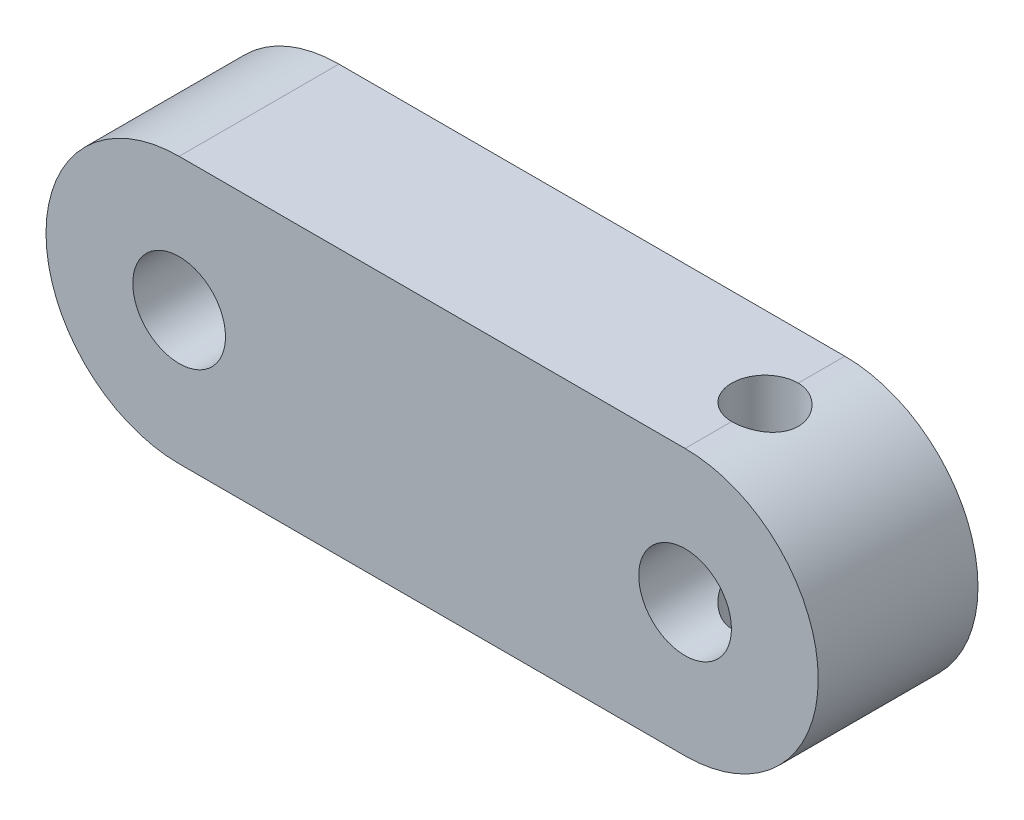
ISO-10303-21;
HEADER;
FILE_DESCRIPTION(('STEP AP214'),'2;1');
FILE_NAME('part.step','',(''),(''),'','','');
FILE_SCHEMA(('AUTOMOTIVE_DESIGN { 1 0 10303 214 1 1 1 1 }'));
ENDSEC;
DATA;
#1=APPLICATION_CONTEXT('core data for automotive mechanical design processes');
#2=APPLICATION_PROTOCOL_DEFINITION('international standard','automotive_design',2000,#1);
#3=PRODUCT_CONTEXT('',#1,'mechanical');
#4=PRODUCT('Part','Part','',(#3));
#5=PRODUCT_RELATED_PRODUCT_CATEGORY('part','',(#4));
#6=PRODUCT_DEFINITION_FORMATION('','',#4);
#7=PRODUCT_DEFINITION_CONTEXT('part definition',#1,'design');
#8=PRODUCT_DEFINITION('design','',#6,#7);
#9=PRODUCT_DEFINITION_SHAPE('','',#8);
#10=(LENGTH_UNIT() NAMED_UNIT(*) SI_UNIT(.MILLI.,.METRE.));
#11=(NAMED_UNIT(*) PLANE_ANGLE_UNIT() SI_UNIT($,.RADIAN.));
#12=(NAMED_UNIT(*) SI_UNIT($,.STERADIAN.) SOLID_ANGLE_UNIT());
#13=UNCERTAINTY_MEASURE_WITH_UNIT(LENGTH_MEASURE(1.E-05),#10,'distance_accuracy_value','');
#14=(GEOMETRIC_REPRESENTATION_CONTEXT(3) GLOBAL_UNCERTAINTY_ASSIGNED_CONTEXT((#13)) GLOBAL_UNIT_ASSIGNED_CONTEXT((#10,
#11,#12)) REPRESENTATION_CONTEXT('',''));
#15=CARTESIAN_POINT('',(0.,0.,0.));
#16=DIRECTION('',(0.,0.,1.));
#17=DIRECTION('',(1.,0.,0.));
#18=AXIS2_PLACEMENT_3D('',#15,#16,#17);
#19=CARTESIAN_POINT('',(-35.0424528301887,-0.806603773584906,6.));
#20=DIRECTION('',(0.,0.,-1.));
#21=DIRECTION('',(-1.,0.,0.));
#22=AXIS2_PLACEMENT_3D('',#19,#20,#21);
#23=CYLINDRICAL_SURFACE('',#22,5.);
#24=CARTESIAN_POINT('',(-35.0424528301887,-0.806603773584906,0.));
#25=DIRECTION('',(0.,0.,1.));
#26=DIRECTION('',(1.,0.,0.));
#27=AXIS2_PLACEMENT_3D('',#24,#25,#26);
#28=CIRCLE('',#27,5.);
#29=CARTESIAN_POINT('',(-35.0424528301887,4.19339622641509,0.));
#30=VERTEX_POINT('',#29);
#31=CARTESIAN_POINT('',(-35.0424528301887,-5.80660377358491,0.));
#32=VERTEX_POINT('',#31);
#33=EDGE_CURVE('E177',#30,#32,#28,.T.);
#34=ORIENTED_EDGE('',*,*,#33,.T.);
#35=DIRECTION('',(0.,0.,-1.));
#36=VECTOR('',#35,1.);
#37=CARTESIAN_POINT('',(-35.0424528301887,-5.80660377358491,6.));
#38=LINE('',#37,#36);
#39=CARTESIAN_POINT('',(-35.0424528301887,-5.80660377358491,6.));
#40=VERTEX_POINT('',#39);
#41=EDGE_CURVE('E11',#40,#32,#38,.T.);
#42=ORIENTED_EDGE('',*,*,#41,.F.);
#43=CARTESIAN_POINT('',(-35.0424528301887,-0.806603773584906,6.));
#44=DIRECTION('',(0.,0.,1.));
#45=DIRECTION('',(1.,0.,0.));
#46=AXIS2_PLACEMENT_3D('',#43,#44,#45);
#47=CIRCLE('',#46,5.);
#48=CARTESIAN_POINT('',(-35.0424528301887,4.19339622641509,6.));
#49=VERTEX_POINT('',#48);
#50=EDGE_CURVE('E222',#49,#40,#47,.T.);
#51=ORIENTED_EDGE('',*,*,#50,.F.);
#52=DIRECTION('',(0.,0.,-1.));
#53=VECTOR('',#52,1.);
#54=CARTESIAN_POINT('',(-35.0424528301887,4.19339622641509,6.));
#55=LINE('',#54,#53);
#56=EDGE_CURVE('E179',#49,#30,#55,.T.);
#57=ORIENTED_EDGE('',*,*,#56,.T.);
#58=EDGE_LOOP('',(#34,#42,#51,#57));
#59=FACE_BOUND('',#58,.T.);
#60=ADVANCED_FACE('F47',(#59),#23,.T.);
#61=CARTESIAN_POINT('',(0.,-5.80660377358491,6.));
#62=DIRECTION('',(0.,1.,0.));
#63=DIRECTION('',(0.,0.,1.));
#64=AXIS2_PLACEMENT_3D('',#61,#62,#63);
#65=PLANE('',#64);
#66=DIRECTION('',(0.,0.,-1.));
#67=VECTOR('',#66,1.);
#68=CARTESIAN_POINT('',(-16.0424528301887,-5.80660377358491,6.));
#69=LINE('',#68,#67);
#70=CARTESIAN_POINT('',(-16.0424528301887,-5.80660377358491,1.75));
#71=VERTEX_POINT('',#70);
#72=CARTESIAN_POINT('',(-16.0424528301887,-5.80660377358491,0.));
#73=VERTEX_POINT('',#72);
#74=EDGE_CURVE('E118',#71,#73,#69,.T.);
#75=ORIENTED_EDGE('',*,*,#74,.F.);
#76=CARTESIAN_POINT('',(-16.0424528301887,-5.80660377358491,3.));
#77=DIRECTION('',(0.,1.,0.));
#78=DIRECTION('',(0.,0.,1.));
#79=AXIS2_PLACEMENT_3D('',#76,#77,#78);
#80=CIRCLE('',#79,1.25);
#81=CARTESIAN_POINT('',(-16.0424528301887,-5.80660377358491,4.25));
#82=VERTEX_POINT('',#81);
#83=EDGE_CURVE('E69',#71,#82,#80,.T.);
#84=ORIENTED_EDGE('',*,*,#83,.T.);
#85=CARTESIAN_POINT('',(-16.0424528301887,-5.80660377358491,6.));
#86=VERTEX_POINT('',#85);
#87=EDGE_CURVE('E62',#86,#82,#69,.T.);
#88=ORIENTED_EDGE('',*,*,#87,.F.);
#89=DIRECTION('',(1.,0.,0.));
#90=VECTOR('',#89,1.);
#91=CARTESIAN_POINT('',(0.,-5.80660377358491,6.));
#92=LINE('',#91,#90);
#93=EDGE_CURVE('E219',#40,#86,#92,.T.);
#94=ORIENTED_EDGE('',*,*,#93,.F.);
#95=ORIENTED_EDGE('',*,*,#41,.T.);
#96=DIRECTION('',(1.,0.,0.));
#97=VECTOR('',#96,1.);
#98=CARTESIAN_POINT('',(0.,-5.80660377358491,0.));
#99=LINE('',#98,#97);
#100=EDGE_CURVE('E184',#32,#73,#99,.T.);
#101=ORIENTED_EDGE('',*,*,#100,.T.);
#102=EDGE_LOOP('',(#75,#84,#88,#94,#95,#101));
#103=FACE_BOUND('',#102,.T.);
#104=ADVANCED_FACE('F115',(#103),#65,.F.);
#105=CARTESIAN_POINT('',(-16.0424528301887,-0.806603773584906,6.));
#106=DIRECTION('',(0.,0.,-1.));
#107=DIRECTION('',(-1.,0.,0.));
#108=AXIS2_PLACEMENT_3D('',#105,#106,#107);
#109=CYLINDRICAL_SURFACE('',#108,5.);
#110=ORIENTED_EDGE('',*,*,#87,.T.);
#111=CARTESIAN_POINT('',(-16.0424528301887,-5.80660377358491,4.25));
#112=CARTESIAN_POINT('',(-16.0078569739585,-5.8066057458428,4.25000037596728));
#113=CARTESIAN_POINT('',(-15.9732781945272,-5.80624427211817,4.24856283362231));
#114=CARTESIAN_POINT('',(-15.9043781401796,-5.80481543028547,4.2428318996049));
#115=CARTESIAN_POINT('',(-15.870056826054,-5.80374817196237,4.23853895209084));
#116=CARTESIAN_POINT('',(-15.7679876908676,-5.7995268855855,4.22143810912928));
#117=CARTESIAN_POINT('',(-15.7009395809455,-5.79535311327812,4.20440795127064));
#118=CARTESIAN_POINT('',(-15.5707638304373,-5.78473469309117,4.15963564004484));
#119=CARTESIAN_POINT('',(-15.5076360424687,-5.77829013064159,4.13189388965756));
#120=CARTESIAN_POINT('',(-15.3869072580954,-5.76381652334429,4.06652314364556));
#121=CARTESIAN_POINT('',(-15.3293075489552,-5.7557871107736,4.02889185273901));
#122=CARTESIAN_POINT('',(-15.2201190813444,-5.73883254954986,3.94400088744876));
#123=CARTESIAN_POINT('',(-15.1686600183779,-5.7298936678649,3.89657720409774));
#124=CARTESIAN_POINT('',(-15.0743321438447,-5.71221792133916,3.79379395796541));
#125=CARTESIAN_POINT('',(-15.0314649402377,-5.70348109458293,3.73843291303242));
#126=CARTESIAN_POINT('',(-14.9549296534347,-5.68706002537897,3.62033577282371));
#127=CARTESIAN_POINT('',(-14.9214075724993,-5.67939333322587,3.55750239807233));
#128=CARTESIAN_POINT('',(-14.865454265014,-5.66618261001165,3.42687282973704));
#129=CARTESIAN_POINT('',(-14.8430206962037,-5.6606381307249,3.35907768771896));
#130=CARTESIAN_POINT('',(-14.8103239790713,-5.65244112577969,3.22188118870494));
#131=CARTESIAN_POINT('',(-14.7998261755374,-5.64973292667627,3.15253915845084));
#132=CARTESIAN_POINT('',(-14.7905679918363,-5.64734845463473,3.0130277818398));
#133=CARTESIAN_POINT('',(-14.7918059669571,-5.6476717568465,2.94285855278733));
#134=CARTESIAN_POINT('',(-14.8057974224229,-5.6512638272916,2.80548652119274));
#135=CARTESIAN_POINT('',(-14.8182709878288,-5.65446099424162,2.73825304428463));
#136=CARTESIAN_POINT('',(-14.8539328872068,-5.66332640489758,2.6068652143792));
#137=CARTESIAN_POINT('',(-14.8771218885374,-5.66899480251075,2.54271105343673));
#138=CARTESIAN_POINT('',(-14.9337952490949,-5.68222980122304,2.41855092105436));
#139=CARTESIAN_POINT('',(-14.9673813320288,-5.68981501520269,2.35859344948368));
#140=CARTESIAN_POINT('',(-15.0438236773181,-5.70601823327899,2.24506647360988));
#141=CARTESIAN_POINT('',(-15.0866813443095,-5.7146363937777,2.19149793913414));
#142=CARTESIAN_POINT('',(-15.1818942518509,-5.73223510272531,2.09066946045423));
#143=CARTESIAN_POINT('',(-15.2344847270305,-5.7412189906529,2.04363198022335));
#144=CARTESIAN_POINT('',(-15.3469302475231,-5.75831829786826,1.95899080021958));
#145=CARTESIAN_POINT('',(-15.406787155664,-5.76643349344983,1.92138952712924));
#146=CARTESIAN_POINT('',(-15.5323929889549,-5.78092288986708,1.85660391585496));
#147=CARTESIAN_POINT('',(-15.5981643242396,-5.78729006363975,1.82946145081492));
#148=CARTESIAN_POINT('',(-15.7334922340217,-5.7975079213212,1.78671476563129));
#149=CARTESIAN_POINT('',(-15.8030431031621,-5.80136229003963,1.77109364600095));
#150=CARTESIAN_POINT('',(-15.9014043502406,-5.80469349623818,1.75765946217707));
#151=CARTESIAN_POINT('',(-15.9295564681795,-5.80540889945623,1.75478660897153));
#152=CARTESIAN_POINT('',(-15.9859522168756,-5.8063637783872,1.7509590589455));
#153=CARTESIAN_POINT('',(-16.0141956203173,-5.80660403659846,1.75000120835114));
#154=CARTESIAN_POINT('',(-16.0424528301887,-5.80660377358491,1.74999999999999));
#155=B_SPLINE_CURVE_WITH_KNOTS('',3,(#111,#112,#113,#114,#115,#116,#117,#118,#119,#120,#121,
#122,#123,#124,#125,#126,#127,#128,#129,#130,#131,#132,#133,#134,#135,#136,#137,#138,#139,#140,
#141,#142,#143,#144,#145,#146,#147,#148,#149,#150,#151,#152,#153,#154),.UNSPECIFIED.,.F.,.F.,(4,
2,2,2,2,2,2,2,2,2,2,2,2,2,2,2,2,2,2,2,2,4),(0.,0.103722196092526,0.20742826196518,
0.414262729871486,0.621089417234319,0.827964149845958,1.03863501957543,1.24934527945168,
1.46318342246191,1.67697637646465,1.88648929459231,2.09597285094458,2.30037759052328,
2.50479506216467,2.7112793574333,2.91779495680266,3.1301776699636,3.34261494514174,
3.55589411497133,3.76885982177052,3.85372663354223,3.93845356459796),.UNSPECIFIED.);
#156=EDGE_CURVE('E105',#82,#71,#155,.T.);
#157=ORIENTED_EDGE('',*,*,#156,.T.);
#158=ORIENTED_EDGE('',*,*,#74,.T.);
#159=CARTESIAN_POINT('',(-16.0424528301887,-0.806603773584906,0.));
#160=DIRECTION('',(0.,0.,1.));
#161=DIRECTION('',(1.,0.,0.));
#162=AXIS2_PLACEMENT_3D('',#159,#160,#161);
#163=CIRCLE('',#162,5.);
#164=CARTESIAN_POINT('',(-16.0424528301887,4.19339622641509,0.));
#165=VERTEX_POINT('',#164);
#166=EDGE_CURVE('E188',#73,#165,#163,.T.);
#167=ORIENTED_EDGE('',*,*,#166,.T.);
#168=DIRECTION('',(0.,0.,-1.));
#169=VECTOR('',#168,1.);
#170=CARTESIAN_POINT('',(-16.0424528301887,4.19339622641509,6.));
#171=LINE('',#170,#169);
#172=CARTESIAN_POINT('',(-16.0424528301887,4.19339622641509,1.75));
#173=VERTEX_POINT('',#172);
#174=EDGE_CURVE('E205',#173,#165,#171,.T.);
#175=ORIENTED_EDGE('',*,*,#174,.F.);
#176=CARTESIAN_POINT('',(-16.0424528301887,4.19339622641509,1.75));
#177=CARTESIAN_POINT('',(-16.0078569739585,4.19339819867299,1.74999962403273));
#178=CARTESIAN_POINT('',(-15.9732781945272,4.19303672494836,1.75143716637769));
#179=CARTESIAN_POINT('',(-15.9043781401796,4.19160788311566,1.7571681003951));
#180=CARTESIAN_POINT('',(-15.870056826054,4.19054062479256,1.76146104790916));
#181=CARTESIAN_POINT('',(-15.7679876908676,4.18631933841568,1.77856189087072));
#182=CARTESIAN_POINT('',(-15.7009395809455,4.18214556610831,1.79559204872936));
#183=CARTESIAN_POINT('',(-15.5707638304373,4.17152714592136,1.84036435995516));
#184=CARTESIAN_POINT('',(-15.5076360424687,4.16508258347177,1.86810611034244));
#185=CARTESIAN_POINT('',(-15.3869072580954,4.15060897617448,1.93347685635444));
#186=CARTESIAN_POINT('',(-15.3293075489552,4.14257956360379,1.97110814726099));
#187=CARTESIAN_POINT('',(-15.2201190813444,4.12562500238005,2.05599911255124));
#188=CARTESIAN_POINT('',(-15.1686600183779,4.11668612069509,2.10342279590226));
#189=CARTESIAN_POINT('',(-15.0743321438447,4.09901037416935,2.20620604203459));
#190=CARTESIAN_POINT('',(-15.0314649402377,4.09027354741312,2.26156708696758));
#191=CARTESIAN_POINT('',(-14.9549296534347,4.07385247820916,2.37966422717629));
#192=CARTESIAN_POINT('',(-14.9214075724993,4.06618578605606,2.44249760192767));
#193=CARTESIAN_POINT('',(-14.865454265014,4.05297506284184,2.57312717026296));
#194=CARTESIAN_POINT('',(-14.8430206962037,4.04743058355509,2.64092231228104));
#195=CARTESIAN_POINT('',(-14.8103239790713,4.03923357860988,2.77811881129506));
#196=CARTESIAN_POINT('',(-14.7998261755374,4.03652537950645,2.84746084154916));
#197=CARTESIAN_POINT('',(-14.7905679918363,4.03414090746492,2.9869722181602));
#198=CARTESIAN_POINT('',(-14.7918059669571,4.03446420967668,3.05714144721267));
#199=CARTESIAN_POINT('',(-14.8057974224229,4.03805628012179,3.19451347880726));
#200=CARTESIAN_POINT('',(-14.8182709878288,4.04125344707181,3.26174695571538));
#201=CARTESIAN_POINT('',(-14.8539328872068,4.05011885772777,3.3931347856208));
#202=CARTESIAN_POINT('',(-14.8771218885374,4.05578725534094,3.45728894656327));
#203=CARTESIAN_POINT('',(-14.9337952490949,4.06902225405323,3.58144907894564));
#204=CARTESIAN_POINT('',(-14.9673813320288,4.07660746803288,3.64140655051632));
#205=CARTESIAN_POINT('',(-15.0438236773181,4.09281068610918,3.75493352639012));
#206=CARTESIAN_POINT('',(-15.0866813443095,4.10142884660789,3.80850206086586));
#207=CARTESIAN_POINT('',(-15.1818942518509,4.1190275555555,3.90933053954577));
#208=CARTESIAN_POINT('',(-15.2344847270305,4.12801144348309,3.95636801977665));
#209=CARTESIAN_POINT('',(-15.3469302475231,4.14511075069845,4.04100919978042));
#210=CARTESIAN_POINT('',(-15.406787155664,4.15322594628002,4.07861047287076));
#211=CARTESIAN_POINT('',(-15.5323929889549,4.16771534269727,4.14339608414504));
#212=CARTESIAN_POINT('',(-15.5981643242396,4.17408251646994,4.17053854918508));
#213=CARTESIAN_POINT('',(-15.7334922340217,4.18430037415139,4.21328523436871));
#214=CARTESIAN_POINT('',(-15.8030431031621,4.18815474286981,4.22890635399905));
#215=CARTESIAN_POINT('',(-15.9014043502406,4.19148594906837,4.24234053782293));
#216=CARTESIAN_POINT('',(-15.9295564681795,4.19220135228642,4.24521339102847));
#217=CARTESIAN_POINT('',(-15.9859522168756,4.19315623121739,4.2490409410545));
#218=CARTESIAN_POINT('',(-16.0141956203173,4.19339648942865,4.24999879164886));
#219=CARTESIAN_POINT('',(-16.0424528301887,4.1933962264151,4.25000000000001));
#220=B_SPLINE_CURVE_WITH_KNOTS('',3,(#176,#177,#178,#179,#180,#181,#182,#183,#184,#185,#186,
#187,#188,#189,#190,#191,#192,#193,#194,#195,#196,#197,#198,#199,#200,#201,#202,#203,#204,#205,
#206,#207,#208,#209,#210,#211,#212,#213,#214,#215,#216,#217,#218,#219),.UNSPECIFIED.,.F.,.F.,(4,
2,2,2,2,2,2,2,2,2,2,2,2,2,2,2,2,2,2,2,2,4),(0.,0.103722196092526,0.20742826196518,
0.414262729871486,0.621089417234321,0.827964149845958,1.03863501957543,1.24934527945168,
1.46318342246191,1.67697637646465,1.88648929459231,2.09597285094458,2.30037759052328,
2.50479506216467,2.7112793574333,2.91779495680266,3.1301776699636,3.34261494514174,
3.55589411497133,3.76885982177052,3.85372663354223,3.93845356459796),.UNSPECIFIED.);
#221=CARTESIAN_POINT('',(-16.0424528301887,4.19339622641509,4.25));
#222=VERTEX_POINT('',#221);
#223=EDGE_CURVE('E76',#173,#222,#220,.T.);
#224=ORIENTED_EDGE('',*,*,#223,.T.);
#225=CARTESIAN_POINT('',(-16.0424528301887,4.19339622641509,6.));
#226=VERTEX_POINT('',#225);
#227=EDGE_CURVE('E129',#226,#222,#171,.T.);
#228=ORIENTED_EDGE('',*,*,#227,.F.);
#229=CARTESIAN_POINT('',(-16.0424528301887,-0.806603773584906,6.));
#230=DIRECTION('',(0.,0.,1.));
#231=DIRECTION('',(1.,0.,0.));
#232=AXIS2_PLACEMENT_3D('',#229,#230,#231);
#233=CIRCLE('',#232,5.);
#234=EDGE_CURVE('E125',#86,#226,#233,.T.);
#235=ORIENTED_EDGE('',*,*,#234,.F.);
#236=EDGE_LOOP('',(#110,#157,#158,#167,#175,#224,#228,#235));
#237=FACE_BOUND('',#236,.T.);
#238=ADVANCED_FACE('F123',(#237),#109,.T.);
#239=CARTESIAN_POINT('',(0.,4.19339622641509,6.));
#240=DIRECTION('',(0.,1.,0.));
#241=DIRECTION('',(0.,0.,1.));
#242=AXIS2_PLACEMENT_3D('',#239,#240,#241);
#243=PLANE('',#242);
#244=CARTESIAN_POINT('',(-16.0424528301887,4.19339622641509,3.));
#245=DIRECTION('',(0.,1.,0.));
#246=DIRECTION('',(0.,0.,1.));
#247=AXIS2_PLACEMENT_3D('',#244,#245,#246);
#248=CIRCLE('',#247,1.25);
#249=EDGE_CURVE('E121',#173,#222,#248,.T.);
#250=ORIENTED_EDGE('',*,*,#249,.F.);
#251=ORIENTED_EDGE('',*,*,#174,.T.);
#252=DIRECTION('',(1.,0.,0.));
#253=VECTOR('',#252,1.);
#254=CARTESIAN_POINT('',(0.,4.19339622641509,0.));
#255=LINE('',#254,#253);
#256=EDGE_CURVE('E197',#30,#165,#255,.T.);
#257=ORIENTED_EDGE('',*,*,#256,.F.);
#258=ORIENTED_EDGE('',*,*,#56,.F.);
#259=DIRECTION('',(1.,0.,0.));
#260=VECTOR('',#259,1.);
#261=CARTESIAN_POINT('',(0.,4.19339622641509,6.));
#262=LINE('',#261,#260);
#263=EDGE_CURVE('E210',#49,#226,#262,.T.);
#264=ORIENTED_EDGE('',*,*,#263,.T.);
#265=ORIENTED_EDGE('',*,*,#227,.T.);
#266=EDGE_LOOP('',(#250,#251,#257,#258,#264,#265));
#267=FACE_BOUND('',#266,.T.);
#268=ADVANCED_FACE('F166',(#267),#243,.T.);
#269=CARTESIAN_POINT('',(-35.0424528301887,-0.806603773584906,6.));
#270=DIRECTION('',(0.,0.,-1.));
#271=DIRECTION('',(-1.,0.,0.));
#272=AXIS2_PLACEMENT_3D('',#269,#270,#271);
#273=CYLINDRICAL_SURFACE('',#272,1.7406778982463);
#274=CARTESIAN_POINT('',(-35.0424528301887,-0.806603773584906,6.));
#275=DIRECTION('',(0.,0.,1.));
#276=DIRECTION('',(1.,0.,0.));
#277=AXIS2_PLACEMENT_3D('',#274,#275,#276);
#278=CIRCLE('',#277,1.7406778982463);
#279=CARTESIAN_POINT('',(-33.3017749319424,-0.806603773584906,6.));
#280=VERTEX_POINT('',#279);
#281=EDGE_CURVE('E203',#280,#280,#278,.T.);
#282=ORIENTED_EDGE('',*,*,#281,.T.);
#283=EDGE_LOOP('',(#282));
#284=FACE_BOUND('',#283,.T.);
#285=CARTESIAN_POINT('',(-35.0424528301887,-0.806603773584906,0.));
#286=DIRECTION('',(0.,0.,1.));
#287=DIRECTION('',(1.,0.,0.));
#288=AXIS2_PLACEMENT_3D('',#285,#286,#287);
#289=CIRCLE('',#288,1.7406778982463);
#290=CARTESIAN_POINT('',(-33.3017749319424,-0.806603773584906,0.));
#291=VERTEX_POINT('',#290);
#292=EDGE_CURVE('E111',#291,#291,#289,.T.);
#293=ORIENTED_EDGE('',*,*,#292,.F.);
#294=EDGE_LOOP('',(#293));
#295=FACE_BOUND('',#294,.T.);
#296=ADVANCED_FACE('F49',(#284,#295),#273,.F.);
#297=CARTESIAN_POINT('',(-16.0424528301887,-0.806603773584906,6.));
#298=DIRECTION('',(0.,0.,-1.));
#299=DIRECTION('',(-1.,0.,0.));
#300=AXIS2_PLACEMENT_3D('',#297,#298,#299);
#301=CYLINDRICAL_SURFACE('',#300,1.7406778982463);
#302=CARTESIAN_POINT('',(-16.0424528301887,-2.5472816718312,4.25));
#303=CARTESIAN_POINT('',(-15.9806571430903,-2.54728399738072,4.25000251005422));
#304=CARTESIAN_POINT('',(-15.9188741275022,-2.54396442119654,4.2453926535699));
#305=CARTESIAN_POINT('',(-15.7973086254389,-2.53101746886575,4.22726652612017));
#306=CARTESIAN_POINT('',(-15.7375268704061,-2.52138781233733,4.2137470353175));
#307=CARTESIAN_POINT('',(-15.6219212442867,-2.49674991927275,4.17868089249348));
#308=CARTESIAN_POINT('',(-15.5660792350091,-2.48176856130912,4.15717433398784));
#309=CARTESIAN_POINT('',(-15.4590924066992,-2.44758162342392,4.10710564226969));
#310=CARTESIAN_POINT('',(-15.4079482392666,-2.428375458764,4.07854253232113));
#311=CARTESIAN_POINT('',(-15.3065974116271,-2.38514052164751,4.01242399527267));
#312=CARTESIAN_POINT('',(-15.2568890676745,-2.36083332849092,3.97429074507277));
#313=CARTESIAN_POINT('',(-15.1641333437684,-2.31036877926638,3.89158506797643));
#314=CARTESIAN_POINT('',(-15.1210961609931,-2.28420867815008,3.84700298093306));
#315=CARTESIAN_POINT('',(-15.0346779194622,-2.2269920930821,3.74314995598331));
#316=CARTESIAN_POINT('',(-14.9927219435843,-2.19592995673119,3.6826892693649));
#317=CARTESIAN_POINT('',(-14.9194953743642,-2.13743632923296,3.55401013412309));
#318=CARTESIAN_POINT('',(-14.8882079486145,-2.10999916105299,3.48580413455754));
#319=CARTESIAN_POINT('',(-14.8459914673388,-2.07111297284614,3.36554160070717));
#320=CARTESIAN_POINT('',(-14.8317507677786,-2.05736331748044,3.31540130666895));
#321=CARTESIAN_POINT('',(-14.8095493941746,-2.03548741645136,3.21260646726651));
#322=CARTESIAN_POINT('',(-14.8015752354427,-2.02734910065457,3.1599575805923));
#323=CARTESIAN_POINT('',(-14.7924229375989,-2.01798059610759,3.0530681077002));
#324=CARTESIAN_POINT('',(-14.791290576309,-2.01679694178921,2.99881923508581));
#325=CARTESIAN_POINT('',(-14.7960466226989,-2.02169202353509,2.89094561057431));
#326=CARTESIAN_POINT('',(-14.8019406621298,-2.02777658517643,2.83732139415216));
#327=CARTESIAN_POINT('',(-14.8214212986263,-2.04726807932278,2.72581752754151));
#328=CARTESIAN_POINT('',(-14.8358737712942,-2.06149187882071,2.66823855076132));
#329=CARTESIAN_POINT('',(-14.872086181296,-2.09532870384729,2.55708140704835));
#330=CARTESIAN_POINT('',(-14.8938625161102,-2.11495380433967,2.50351255040186));
#331=CARTESIAN_POINT('',(-14.9518821111971,-2.16398080195043,2.38451201759426));
#332=CARTESIAN_POINT('',(-14.9905235486482,-2.19450799523386,2.32071812598212));
#333=CARTESIAN_POINT('',(-15.078091108363,-2.25672858474513,2.20125257925785));
#334=CARTESIAN_POINT('',(-15.1270276560766,-2.28842313606482,2.14558925520549));
#335=CARTESIAN_POINT('',(-15.2352263470152,-2.3500629031855,2.04265143219594));
#336=CARTESIAN_POINT('',(-15.2945922059921,-2.37998607659612,1.99547186496989));
#337=CARTESIAN_POINT('',(-15.4225297731049,-2.43462836356552,1.91188198105753));
#338=CARTESIAN_POINT('',(-15.4910798440512,-2.45935936816168,1.87544697806263));
#339=CARTESIAN_POINT('',(-15.6172679102043,-2.49548528791615,1.8230895106228));
#340=CARTESIAN_POINT('',(-15.6732085344019,-2.50867342517864,1.80430376645266));
#341=CARTESIAN_POINT('',(-15.7881446598496,-2.52959186140428,1.77470834966697));
#342=CARTESIAN_POINT('',(-15.8471378968226,-2.53732614520128,1.76389285336426));
#343=CARTESIAN_POINT('',(-15.9667567161949,-2.54667255464183,1.75083994868879));
#344=CARTESIAN_POINT('',(-16.0273870378893,-2.54826441780557,1.74863093094299));
#345=CARTESIAN_POINT('',(-16.1481649237623,-2.54511861774125,1.75301295991402));
#346=CARTESIAN_POINT('',(-16.2083124445228,-2.54038039152626,1.75960478936258));
#347=CARTESIAN_POINT('',(-16.3233103242918,-2.52540449545695,1.7806284798892));
#348=CARTESIAN_POINT('',(-16.3782750878853,-2.51545434162783,1.79465086625196));
#349=CARTESIAN_POINT('',(-16.4848846657125,-2.49100514866749,1.8295712469024));
#350=CARTESIAN_POINT('',(-16.5365287990351,-2.47650518013669,1.85047064601345));
#351=CARTESIAN_POINT('',(-16.6400740386265,-2.44246355844589,1.90048033651998));
#352=CARTESIAN_POINT('',(-16.6915906789237,-2.42258852891777,1.93015497864482));
#353=CARTESIAN_POINT('',(-16.7891164503031,-2.3799099188844,1.99578179499924));
#354=CARTESIAN_POINT('',(-16.8351214424075,-2.35710416385523,2.03173863765774));
#355=CARTESIAN_POINT('',(-16.9291149577316,-2.30565497703007,2.11624620691267));
#356=CARTESIAN_POINT('',(-16.9759453973706,-2.27670370924886,2.16589814250149));
#357=CARTESIAN_POINT('',(-17.061053053331,-2.21906726603717,2.2722652007403));
#358=CARTESIAN_POINT('',(-17.099325008353,-2.19038226462047,2.32898463493477));
#359=CARTESIAN_POINT('',(-17.1617177197312,-2.14023301655119,2.44035359773939));
#360=CARTESIAN_POINT('',(-17.1870879754765,-2.11832569292153,2.49410003786427));
#361=CARTESIAN_POINT('',(-17.2302980127372,-2.07933028431619,2.60615800911694));
#362=CARTESIAN_POINT('',(-17.2481536894955,-2.06223205257784,2.6644595918532));
#363=CARTESIAN_POINT('',(-17.2726721210218,-2.03817132594363,2.7730123676553));
#364=CARTESIAN_POINT('',(-17.2808368212056,-2.02988392687093,2.82262239573214));
#365=CARTESIAN_POINT('',(-17.2911018992275,-2.01940751253285,2.92308137006537));
#366=CARTESIAN_POINT('',(-17.2932096008992,-2.01721113241053,2.97392874505592));
#367=CARTESIAN_POINT('',(-17.2912096322874,-2.01927313855977,3.07538556122322));
#368=CARTESIAN_POINT('',(-17.2870990476935,-2.02353455139246,3.12599487967798));
#369=CARTESIAN_POINT('',(-17.2729634799542,-2.03782263394089,3.2255709137725));
#370=CARTESIAN_POINT('',(-17.2629292644484,-2.04785830258579,3.27453493893708));
#371=CARTESIAN_POINT('',(-17.2333090293016,-2.07639367934943,3.38557122004445));
#372=CARTESIAN_POINT('',(-17.2116654098391,-2.09659252302129,3.44664857121826));
#373=CARTESIAN_POINT('',(-17.1601171941418,-2.14150207316028,3.56339791127319));
#374=CARTESIAN_POINT('',(-17.1301987996461,-2.16622029218531,3.61906065984305));
#375=CARTESIAN_POINT('',(-17.0619248434637,-2.21817328331895,3.72616615526967));
#376=CARTESIAN_POINT('',(-17.0233584798318,-2.24545880611097,3.77744924635664));
#377=CARTESIAN_POINT('',(-16.9387325427546,-2.29964459533902,3.87366404970909));
#378=CARTESIAN_POINT('',(-16.8926703603995,-2.32654472407964,3.91859354039988));
#379=CARTESIAN_POINT('',(-16.7841750795286,-2.38273638758834,4.00906549457239));
#380=CARTESIAN_POINT('',(-16.7202895533859,-2.41155299182046,4.05319067032532));
#381=CARTESIAN_POINT('',(-16.5834317129145,-2.46268610631236,4.12958018400772));
#382=CARTESIAN_POINT('',(-16.5104730924906,-2.48501224655714,4.16186211275324));
#383=CARTESIAN_POINT('',(-16.3719577840711,-2.51700083834021,4.20756347549221));
#384=CARTESIAN_POINT('',(-16.3075616441823,-2.52824924511708,4.22337907621714));
#385=CARTESIAN_POINT('',(-16.1762542944313,-2.54338407274782,4.24458985040332));
#386=CARTESIAN_POINT('',(-16.1093461381487,-2.54727915444355,4.24999728288756));
#387=CARTESIAN_POINT('',(-16.0424528301887,-2.5472816718312,4.25));
#388=B_SPLINE_CURVE_WITH_KNOTS('',3,(#302,#303,#304,#305,#306,#307,#308,#309,#310,#311,#312,
#313,#314,#315,#316,#317,#318,#319,#320,#321,#322,#323,#324,#325,#326,#327,#328,#329,#330,#331,
#332,#333,#334,#335,#336,#337,#338,#339,#340,#341,#342,#343,#344,#345,#346,#347,#348,#349,#350,
#351,#352,#353,#354,#355,#356,#357,#358,#359,#360,#361,#362,#363,#364,#365,#366,#367,#368,#369,
#370,#371,#372,#373,#374,#375,#376,#377,#378,#379,#380,#381,#382,#383,#384,#385,#386,#387),
.UNSPECIFIED.,.T.,.F.,(4,2,2,2,2,2,2,2,2,2,2,2,2,2,2,2,2,2,2,2,2,2,2,2,2,2,2,2,2,2,2,2,2,2,2,2,
2,2,2,2,2,2,4),(0.,0.185115545747067,0.370298026791846,0.554563223601302,0.738853939873049,
0.939724875800207,1.14089988719668,1.37949511281722,1.61771213156264,1.77884312479173,
1.93962643072944,2.10148434181079,2.26347207137399,2.44561455607942,2.62816758695251,
2.86871542182509,3.10950803271459,3.35284690064959,3.59562224676626,3.77626352011121,
3.95677267157011,4.13787677605316,4.31899698868677,4.49104001961181,4.66311821700764,
4.85047789357392,5.03797739770103,5.25954099856829,5.48124043274621,5.67062897181718,
5.8596148676611,6.01182489748158,6.16385080459812,6.3159479834362,6.46828284370888,
6.67079637557595,6.87364965796701,7.0821234274469,7.29066991174826,7.53770589176355,
7.78437344844721,7.98499590256193,8.18538191316056),.UNSPECIFIED.);
#389=CARTESIAN_POINT('',(-16.0424528301887,-2.5472816718312,4.25));
#390=VERTEX_POINT('',#389);
#391=EDGE_CURVE('E51',#390,#390,#388,.T.);
#392=ORIENTED_EDGE('',*,*,#391,.F.);
#393=EDGE_LOOP('',(#392));
#394=FACE_BOUND('',#393,.T.);
#395=CARTESIAN_POINT('',(-16.0424528301887,0.934074124661393,4.25));
#396=CARTESIAN_POINT('',(-16.1042485172871,0.934076450210908,4.25000251005422));
#397=CARTESIAN_POINT('',(-16.1660315328752,0.930756874026726,4.2453926535699));
#398=CARTESIAN_POINT('',(-16.2875970349385,0.917809921695943,4.22726652612017));
#399=CARTESIAN_POINT('',(-16.3473787899713,0.908180265167521,4.2137470353175));
#400=CARTESIAN_POINT('',(-16.4629844160906,0.883542372102936,4.17868089249348));
#401=CARTESIAN_POINT('',(-16.5188264253683,0.868561014139311,4.15717433398784));
#402=CARTESIAN_POINT('',(-16.6258132536782,0.834374076254106,4.1071056422697));
#403=CARTESIAN_POINT('',(-16.6769574211108,0.815167911594187,4.07854253232114));
#404=CARTESIAN_POINT('',(-16.7783082487503,0.771932974477703,4.01242399527267));
#405=CARTESIAN_POINT('',(-16.8280165927028,0.747625781321107,3.97429074507277));
#406=CARTESIAN_POINT('',(-16.920772316609,0.697161232096569,3.89158506797643));
#407=CARTESIAN_POINT('',(-16.9638094993843,0.671001130980266,3.84700298093307));
#408=CARTESIAN_POINT('',(-17.0502277409152,0.613784545912294,3.74314995598331));
#409=CARTESIAN_POINT('',(-17.0921837167931,0.58272240956138,3.68268926936491));
#410=CARTESIAN_POINT('',(-17.1654102860131,0.524228782063151,3.55401013412309));
#411=CARTESIAN_POINT('',(-17.1966977117629,0.496791613883179,3.48580413455754));
#412=CARTESIAN_POINT('',(-17.2389141930386,0.457905425676329,3.36554160070717));
#413=CARTESIAN_POINT('',(-17.2531548925987,0.444155770310629,3.31540130666895));
#414=CARTESIAN_POINT('',(-17.2753562662028,0.422279869281552,3.21260646726651));
#415=CARTESIAN_POINT('',(-17.2833304249347,0.414141553484757,3.15995758059231));
#416=CARTESIAN_POINT('',(-17.2924827227785,0.404773048937775,3.0530681077002));
#417=CARTESIAN_POINT('',(-17.2936150840684,0.403589394619393,2.99881923508582));
#418=CARTESIAN_POINT('',(-17.2888590376785,0.408484476365272,2.89094561057431));
#419=CARTESIAN_POINT('',(-17.2829649982476,0.414569038006617,2.83732139415217));
#420=CARTESIAN_POINT('',(-17.263484361751,0.434060532152966,2.72581752754152));
#421=CARTESIAN_POINT('',(-17.2490318890831,0.448284331650898,2.66823855076133));
#422=CARTESIAN_POINT('',(-17.2128194790814,0.482121156677478,2.55708140704835));
#423=CARTESIAN_POINT('',(-17.1910431442672,0.50174625716986,2.50351255040187));
#424=CARTESIAN_POINT('',(-17.1330235491803,0.550773254780611,2.38451201759427));
#425=CARTESIAN_POINT('',(-17.0943821117291,0.581300448064046,2.32071812598212));
#426=CARTESIAN_POINT('',(-17.0068145520144,0.64352103757532,2.20125257925786));
#427=CARTESIAN_POINT('',(-16.9578780043007,0.675215588895008,2.14558925520549));
#428=CARTESIAN_POINT('',(-16.8496793133622,0.736855356015682,2.04265143219595));
#429=CARTESIAN_POINT('',(-16.7903134543853,0.766778529426302,1.99547186496989));
#430=CARTESIAN_POINT('',(-16.6623758872725,0.821420816395701,1.91188198105753));
#431=CARTESIAN_POINT('',(-16.5938258163262,0.846151820991866,1.87544697806264));
#432=CARTESIAN_POINT('',(-16.467637750173,0.882277740746331,1.8230895106228));
#433=CARTESIAN_POINT('',(-16.4116971259755,0.895465878008823,1.80430376645266));
#434=CARTESIAN_POINT('',(-16.2967610005278,0.91638431423447,1.77470834966697));
#435=CARTESIAN_POINT('',(-16.2377677635547,0.92411859803147,1.76389285336426));
#436=CARTESIAN_POINT('',(-16.1181489441825,0.93346500747202,1.75083994868879));
#437=CARTESIAN_POINT('',(-16.0575186224881,0.935056870635756,1.74863093094299));
#438=CARTESIAN_POINT('',(-15.936740736615,0.931911070571439,1.75301295991402));
#439=CARTESIAN_POINT('',(-15.8765932158546,0.927172844356451,1.75960478936258));
#440=CARTESIAN_POINT('',(-15.7615953360856,0.912196948287143,1.7806284798892));
#441=CARTESIAN_POINT('',(-15.7066305724921,0.902246794458023,1.79465086625196));
#442=CARTESIAN_POINT('',(-15.6000209946649,0.877797601497674,1.8295712469024));
#443=CARTESIAN_POINT('',(-15.5483768613423,0.863297632966879,1.85047064601345));
#444=CARTESIAN_POINT('',(-15.4448316217509,0.829256011276082,1.90048033651998));
#445=CARTESIAN_POINT('',(-15.3933149814537,0.809380981747959,1.93015497864482));
#446=CARTESIAN_POINT('',(-15.2957892100742,0.766702371714588,1.99578179499924));
#447=CARTESIAN_POINT('',(-15.2497842179699,0.743896616685414,2.03173863765774));
#448=CARTESIAN_POINT('',(-15.1557907026458,0.692447429860255,2.11624620691267));
#449=CARTESIAN_POINT('',(-15.1089602630068,0.663496162079051,2.16589814250149));
#450=CARTESIAN_POINT('',(-15.0238526070463,0.605859718867361,2.2722652007403));
#451=CARTESIAN_POINT('',(-14.9855806520243,0.577174717450653,2.32898463493477));
#452=CARTESIAN_POINT('',(-14.9231879406462,0.527025469381381,2.4403535977394));
#453=CARTESIAN_POINT('',(-14.8978176849009,0.505118145751721,2.49410003786427));
#454=CARTESIAN_POINT('',(-14.8546076476401,0.466122737146379,2.60615800911694));
#455=CARTESIAN_POINT('',(-14.8367519708818,0.449024505408026,2.66445959185321));
#456=CARTESIAN_POINT('',(-14.8122335393555,0.424963778773819,2.77301236765531));
#457=CARTESIAN_POINT('',(-14.8040688391717,0.416676379701115,2.82262239573214));
#458=CARTESIAN_POINT('',(-14.7938037611499,0.406199965363035,2.92308137006538));
#459=CARTESIAN_POINT('',(-14.7916960594782,0.404003585240717,2.97392874505592));
#460=CARTESIAN_POINT('',(-14.79369602809,0.40606559138996,3.07538556122322));
#461=CARTESIAN_POINT('',(-14.7978066126839,0.410327004222651,3.12599487967798));
#462=CARTESIAN_POINT('',(-14.8119421804232,0.424615086771078,3.2255709137725));
#463=CARTESIAN_POINT('',(-14.8219763959289,0.434650755415975,3.27453493893709));
#464=CARTESIAN_POINT('',(-14.8515966310757,0.463186132179614,3.38557122004445));
#465=CARTESIAN_POINT('',(-14.8732402505383,0.483384975851477,3.44664857121826));
#466=CARTESIAN_POINT('',(-14.9247884662355,0.528294525990464,3.56339791127319));
#467=CARTESIAN_POINT('',(-14.9547068607312,0.553012745015502,3.61906065984305));
#468=CARTESIAN_POINT('',(-15.0229808169137,0.604965736149135,3.72616615526968));
#469=CARTESIAN_POINT('',(-15.0615471805456,0.632251258941154,3.77744924635664));
#470=CARTESIAN_POINT('',(-15.1461731176228,0.686437048169205,3.8736640497091));
#471=CARTESIAN_POINT('',(-15.1922352999779,0.713337176909832,3.91859354039988));
#472=CARTESIAN_POINT('',(-15.3007305808488,0.769528840418531,4.0090654945724));
#473=CARTESIAN_POINT('',(-15.3646161069915,0.798345444650649,4.05319067032532));
#474=CARTESIAN_POINT('',(-15.5014739474628,0.849478559142553,4.12958018400772));
#475=CARTESIAN_POINT('',(-15.5744325678868,0.871804699387334,4.16186211275324));
#476=CARTESIAN_POINT('',(-15.7129478763062,0.903793291170395,4.20756347549221));
#477=CARTESIAN_POINT('',(-15.777344016195,0.91504169794727,4.22337907621715));
#478=CARTESIAN_POINT('',(-15.9086513659461,0.930176525578004,4.24458985040332));
#479=CARTESIAN_POINT('',(-15.9755595222287,0.934071607273738,4.24999728288756));
#480=CARTESIAN_POINT('',(-16.0424528301887,0.934074124661393,4.25));
#481=B_SPLINE_CURVE_WITH_KNOTS('',3,(#395,#396,#397,#398,#399,#400,#401,#402,#403,#404,#405,
#406,#407,#408,#409,#410,#411,#412,#413,#414,#415,#416,#417,#418,#419,#420,#421,#422,#423,#424,
#425,#426,#427,#428,#429,#430,#431,#432,#433,#434,#435,#436,#437,#438,#439,#440,#441,#442,#443,
#444,#445,#446,#447,#448,#449,#450,#451,#452,#453,#454,#455,#456,#457,#458,#459,#460,#461,#462,
#463,#464,#465,#466,#467,#468,#469,#470,#471,#472,#473,#474,#475,#476,#477,#478,#479,#480),
.UNSPECIFIED.,.T.,.F.,(4,2,2,2,2,2,2,2,2,2,2,2,2,2,2,2,2,2,2,2,2,2,2,2,2,2,2,2,2,2,2,2,2,2,2,2,
2,2,2,2,2,2,4),(0.,0.185115545747063,0.370298026791842,0.554563223601295,0.738853939873044,
0.939724875800205,1.14089988719667,1.37949511281721,1.61771213156263,1.77884312479173,
1.93962643072944,2.10148434181078,2.26347207137399,2.44561455607941,2.6281675869525,
2.86871542182508,3.10950803271458,3.35284690064958,3.59562224676625,3.7762635201112,
3.95677267157011,4.13787677605316,4.31899698868677,4.4910400196118,4.66311821700764,
4.85047789357391,5.03797739770104,5.25954099856829,5.4812404327462,5.67062897181719,
5.8596148676611,6.01182489748158,6.16385080459812,6.31594798343621,6.46828284370888,
6.67079637557595,6.87364965796701,7.08212342744691,7.29066991174827,7.53770589176355,
7.78437344844722,7.98499590256194,8.18538191316056),.UNSPECIFIED.);
#482=CARTESIAN_POINT('',(-16.0424528301887,0.934074124661393,4.25));
#483=VERTEX_POINT('',#482);
#484=EDGE_CURVE('E120',#483,#483,#481,.T.);
#485=ORIENTED_EDGE('',*,*,#484,.F.);
#486=EDGE_LOOP('',(#485));
#487=FACE_BOUND('',#486,.T.);
#488=CARTESIAN_POINT('',(-16.0424528301887,-0.806603773584906,6.));
#489=DIRECTION('',(0.,0.,1.));
#490=DIRECTION('',(1.,0.,0.));
#491=AXIS2_PLACEMENT_3D('',#488,#489,#490);
#492=CIRCLE('',#491,1.7406778982463);
#493=CARTESIAN_POINT('',(-14.3017749319424,-0.806603773584906,6.));
#494=VERTEX_POINT('',#493);
#495=EDGE_CURVE('E206',#494,#494,#492,.T.);
#496=ORIENTED_EDGE('',*,*,#495,.T.);
#497=EDGE_LOOP('',(#496));
#498=FACE_BOUND('',#497,.T.);
#499=CARTESIAN_POINT('',(-16.0424528301887,-0.806603773584906,0.));
#500=DIRECTION('',(0.,0.,1.));
#501=DIRECTION('',(1.,0.,0.));
#502=AXIS2_PLACEMENT_3D('',#499,#500,#501);
#503=CIRCLE('',#502,1.7406778982463);
#504=CARTESIAN_POINT('',(-14.3017749319424,-0.806603773584906,0.));
#505=VERTEX_POINT('',#504);
#506=EDGE_CURVE('E200',#505,#505,#503,.T.);
#507=ORIENTED_EDGE('',*,*,#506,.F.);
#508=EDGE_LOOP('',(#507));
#509=FACE_BOUND('',#508,.T.);
#510=ADVANCED_FACE('F137',(#394,#487,#498,#509),#301,.F.);
#511=CARTESIAN_POINT('',(0.,0.,6.));
#512=DIRECTION('',(0.,0.,1.));
#513=DIRECTION('',(1.,0.,0.));
#514=AXIS2_PLACEMENT_3D('',#511,#512,#513);
#515=PLANE('',#514);
#516=ORIENTED_EDGE('',*,*,#281,.F.);
#517=EDGE_LOOP('',(#516));
#518=FACE_BOUND('',#517,.T.);
#519=ORIENTED_EDGE('',*,*,#50,.T.);
#520=ORIENTED_EDGE('',*,*,#93,.T.);
#521=ORIENTED_EDGE('',*,*,#234,.T.);
#522=ORIENTED_EDGE('',*,*,#263,.F.);
#523=EDGE_LOOP('',(#519,#520,#521,#522));
#524=FACE_BOUND('',#523,.T.);
#525=ORIENTED_EDGE('',*,*,#495,.F.);
#526=EDGE_LOOP('',(#525));
#527=FACE_BOUND('',#526,.T.);
#528=ADVANCED_FACE('F146',(#518,#524,#527),#515,.T.);
#529=CARTESIAN_POINT('',(0.,0.,0.));
#530=DIRECTION('',(0.,0.,1.));
#531=DIRECTION('',(1.,0.,0.));
#532=AXIS2_PLACEMENT_3D('',#529,#530,#531);
#533=PLANE('',#532);
#534=ORIENTED_EDGE('',*,*,#292,.T.);
#535=EDGE_LOOP('',(#534));
#536=FACE_BOUND('',#535,.T.);
#537=ORIENTED_EDGE('',*,*,#33,.F.);
#538=ORIENTED_EDGE('',*,*,#256,.T.);
#539=ORIENTED_EDGE('',*,*,#166,.F.);
#540=ORIENTED_EDGE('',*,*,#100,.F.);
#541=EDGE_LOOP('',(#537,#538,#539,#540));
#542=FACE_BOUND('',#541,.T.);
#543=ORIENTED_EDGE('',*,*,#506,.T.);
#544=EDGE_LOOP('',(#543));
#545=FACE_BOUND('',#544,.T.);
#546=ADVANCED_FACE('F233',(#536,#542,#545),#533,.F.);
#547=CARTESIAN_POINT('',(-16.0424528301887,-5.80660377358491,3.));
#548=DIRECTION('',(0.,1.,0.));
#549=DIRECTION('',(0.,0.,1.));
#550=AXIS2_PLACEMENT_3D('',#547,#548,#549);
#551=CYLINDRICAL_SURFACE('',#550,1.25);
#552=ORIENTED_EDGE('',*,*,#484,.T.);
#553=EDGE_LOOP('',(#552));
#554=FACE_BOUND('',#553,.T.);
#555=ORIENTED_EDGE('',*,*,#249,.T.);
#556=ORIENTED_EDGE('',*,*,#223,.F.);
#557=EDGE_LOOP('',(#555,#556));
#558=FACE_BOUND('',#557,.T.);
#559=ADVANCED_FACE('F144',(#554,#558),#551,.F.);
#560=ORIENTED_EDGE('',*,*,#391,.T.);
#561=EDGE_LOOP('',(#560));
#562=FACE_BOUND('',#561,.T.);
#563=ORIENTED_EDGE('',*,*,#83,.F.);
#564=ORIENTED_EDGE('',*,*,#156,.F.);
#565=EDGE_LOOP('',(#563,#564));
#566=FACE_BOUND('',#565,.T.);
#567=ADVANCED_FACE('F106',(#562,#566),#551,.F.);
#568=CLOSED_SHELL('',(#60,#104,#238,#268,#296,#510,#528,#546,#559,#567));
#569=MANIFOLD_SOLID_BREP('B2',#568);
#570=ADVANCED_BREP_SHAPE_REPRESENTATION('',(#18,#569),#14);
#571=SHAPE_DEFINITION_REPRESENTATION(#9,#570);
ENDSEC;
END-ISO-10303-21;
